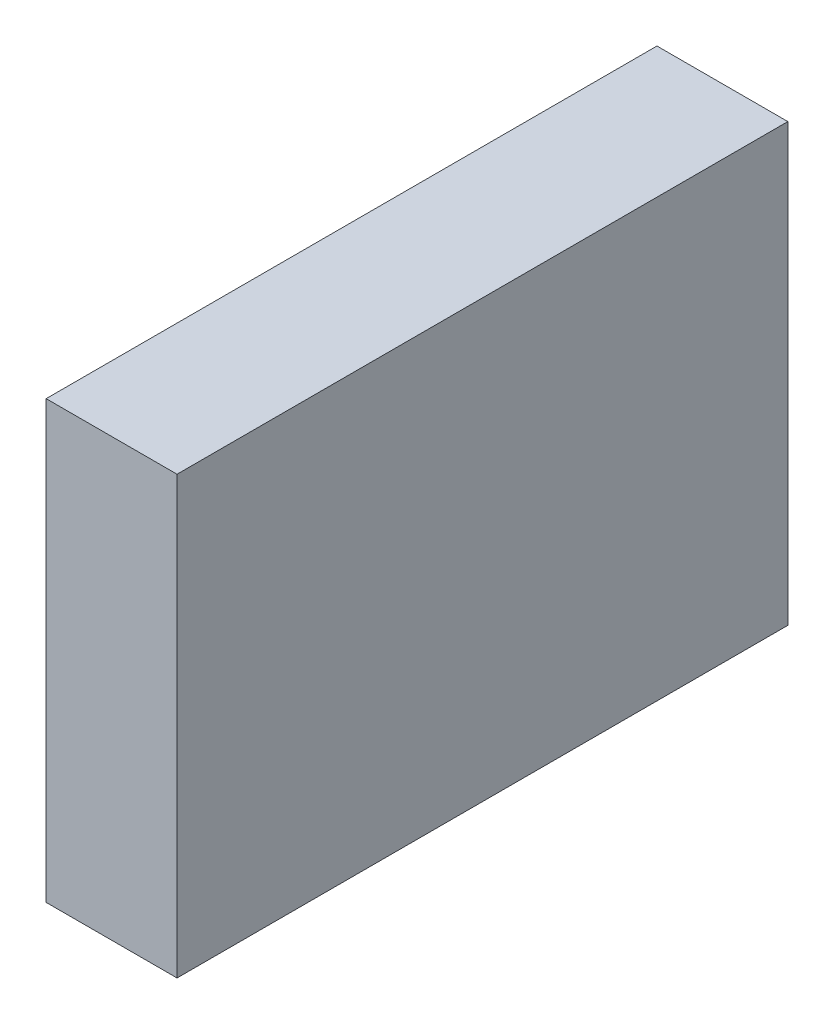
ISO-10303-21;
HEADER;
FILE_DESCRIPTION(('STEP AP214'),'2;1');
FILE_NAME('part.step','',(''),(''),'','','');
FILE_SCHEMA(('AUTOMOTIVE_DESIGN { 1 0 10303 214 1 1 1 1 }'));
ENDSEC;
DATA;
#1=APPLICATION_CONTEXT('core data for automotive mechanical design processes');
#2=APPLICATION_PROTOCOL_DEFINITION('international standard','automotive_design',2000,#1);
#3=PRODUCT_CONTEXT('',#1,'mechanical');
#4=PRODUCT('Part','Part','',(#3));
#5=PRODUCT_RELATED_PRODUCT_CATEGORY('part','',(#4));
#6=PRODUCT_DEFINITION_FORMATION('','',#4);
#7=PRODUCT_DEFINITION_CONTEXT('part definition',#1,'design');
#8=PRODUCT_DEFINITION('design','',#6,#7);
#9=PRODUCT_DEFINITION_SHAPE('','',#8);
#10=(LENGTH_UNIT() NAMED_UNIT(*) SI_UNIT(.MILLI.,.METRE.));
#11=(NAMED_UNIT(*) PLANE_ANGLE_UNIT() SI_UNIT($,.RADIAN.));
#12=(NAMED_UNIT(*) SI_UNIT($,.STERADIAN.) SOLID_ANGLE_UNIT());
#13=UNCERTAINTY_MEASURE_WITH_UNIT(LENGTH_MEASURE(1.E-05),#10,'distance_accuracy_value','');
#14=(GEOMETRIC_REPRESENTATION_CONTEXT(3) GLOBAL_UNCERTAINTY_ASSIGNED_CONTEXT((#13)) GLOBAL_UNIT_ASSIGNED_CONTEXT((#10,
#11,#12)) REPRESENTATION_CONTEXT('',''));
#15=CARTESIAN_POINT('',(0.,0.,0.));
#16=DIRECTION('',(0.,0.,1.));
#17=DIRECTION('',(1.,0.,0.));
#18=AXIS2_PLACEMENT_3D('',#15,#16,#17);
#19=CARTESIAN_POINT('',(3.,-1.82000017746824,-3.72112168010555));
#20=DIRECTION('',(1.,0.,0.));
#21=DIRECTION('',(0.,1.,8.74227765734759E-08));
#22=AXIS2_PLACEMENT_3D('',#19,#20,#21);
#23=PLANE('',#22);
#24=DIRECTION('',(0.,0.999999999999996,8.74227765733007E-08));
#25=VECTOR('',#24,1.);
#26=CARTESIAN_POINT('',(3.,-1.75000018358783,-3.65112167398595));
#27=LINE('',#26,#25);
#28=CARTESIAN_POINT('',(3.,-1.75000018358683,-3.65112167398595));
#29=VERTEX_POINT('',#28);
#30=CARTESIAN_POINT('',(3.,-0.750000183585831,-3.65112158656218));
#31=VERTEX_POINT('',#30);
#32=EDGE_CURVE('E11',#29,#31,#27,.T.);
#33=ORIENTED_EDGE('',*,*,#32,.F.);
#34=DIRECTION('',(0.,8.74227766369168E-08,-0.999999999999996));
#35=VECTOR('',#34,1.);
#36=CARTESIAN_POINT('',(3.,-1.75000030597972,-2.25112167398595));
#37=LINE('',#36,#35);
#38=CARTESIAN_POINT('',(3.,-1.75000030597972,-2.25112167398695));
#39=VERTEX_POINT('',#38);
#40=EDGE_CURVE('E59',#39,#29,#37,.T.);
#41=ORIENTED_EDGE('',*,*,#40,.F.);
#42=DIRECTION('',(0.,-0.999999999999996,-8.74227765733007E-08));
#43=VECTOR('',#42,1.);
#44=CARTESIAN_POINT('',(3.,-0.750000305977718,-2.25112158656318));
#45=LINE('',#44,#43);
#46=CARTESIAN_POINT('',(3.,-0.750000305978718,-2.25112158656318));
#47=VERTEX_POINT('',#46);
#48=EDGE_CURVE('E79',#47,#39,#45,.T.);
#49=ORIENTED_EDGE('',*,*,#48,.F.);
#50=DIRECTION('',(0.,-8.74227765576152E-08,0.999999999999996));
#51=VECTOR('',#50,1.);
#52=CARTESIAN_POINT('',(3.,-0.750000183585831,-3.65112158656318));
#53=LINE('',#52,#51);
#54=EDGE_CURVE('E84',#31,#47,#53,.T.);
#55=ORIENTED_EDGE('',*,*,#54,.F.);
#56=EDGE_LOOP('',(#33,#41,#49,#55));
#57=FACE_BOUND('',#56,.T.);
#58=ADVANCED_FACE('F17',(#57),#23,.F.);
#59=CARTESIAN_POINT('',(3.3,-1.82000017746824,-3.72112168010555));
#60=DIRECTION('',(1.,0.,0.));
#61=DIRECTION('',(0.,1.,8.74227765734759E-08));
#62=AXIS2_PLACEMENT_3D('',#59,#60,#61);
#63=PLANE('',#62);
#64=DIRECTION('',(0.,-8.74227765576152E-08,0.999999999999996));
#65=VECTOR('',#64,1.);
#66=CARTESIAN_POINT('',(3.3,-0.750000183585831,-3.65112158656318));
#67=LINE('',#66,#65);
#68=CARTESIAN_POINT('',(3.3,-0.750000183585831,-3.65112158656218));
#69=VERTEX_POINT('',#68);
#70=CARTESIAN_POINT('',(3.3,-0.750000305978718,-2.25112158656318));
#71=VERTEX_POINT('',#70);
#72=EDGE_CURVE('E24',#69,#71,#67,.T.);
#73=ORIENTED_EDGE('',*,*,#72,.T.);
#74=DIRECTION('',(0.,-0.999999999999996,-8.74227765733007E-08));
#75=VECTOR('',#74,1.);
#76=CARTESIAN_POINT('',(3.3,-0.750000305977718,-2.25112158656318));
#77=LINE('',#76,#75);
#78=CARTESIAN_POINT('',(3.3,-1.75000030597972,-2.25112167398695));
#79=VERTEX_POINT('',#78);
#80=EDGE_CURVE('E82',#71,#79,#77,.T.);
#81=ORIENTED_EDGE('',*,*,#80,.T.);
#82=DIRECTION('',(0.,8.74227764783136E-08,-0.999999999999996));
#83=VECTOR('',#82,1.);
#84=CARTESIAN_POINT('',(3.3,-1.75000030597972,-2.25112167398595));
#85=LINE('',#84,#83);
#86=CARTESIAN_POINT('',(3.3,-1.75000018358683,-3.65112167398595));
#87=VERTEX_POINT('',#86);
#88=EDGE_CURVE('E64',#79,#87,#85,.T.);
#89=ORIENTED_EDGE('',*,*,#88,.T.);
#90=DIRECTION('',(0.,0.999999999999996,8.74227765733007E-08));
#91=VECTOR('',#90,1.);
#92=CARTESIAN_POINT('',(3.3,-1.75000018358783,-3.65112167398595));
#93=LINE('',#92,#91);
#94=EDGE_CURVE('E61',#87,#69,#93,.T.);
#95=ORIENTED_EDGE('',*,*,#94,.T.);
#96=EDGE_LOOP('',(#73,#81,#89,#95));
#97=FACE_BOUND('',#96,.T.);
#98=ADVANCED_FACE('F62',(#97),#63,.T.);
#99=CARTESIAN_POINT('',(3.,-0.750000183585831,-3.65112158656318));
#100=DIRECTION('',(0.,1.,8.74227765734759E-08));
#101=DIRECTION('',(0.,-8.74227765734759E-08,1.));
#102=AXIS2_PLACEMENT_3D('',#99,#100,#101);
#103=PLANE('',#102);
#104=ORIENTED_EDGE('',*,*,#54,.T.);
#105=DIRECTION('',(1.,0.,0.));
#106=VECTOR('',#105,1.);
#107=CARTESIAN_POINT('',(3.,-0.750000305977718,-2.25112158656318));
#108=LINE('',#107,#106);
#109=EDGE_CURVE('E57',#47,#71,#108,.T.);
#110=ORIENTED_EDGE('',*,*,#109,.T.);
#111=ORIENTED_EDGE('',*,*,#72,.F.);
#112=DIRECTION('',(1.,0.,0.));
#113=VECTOR('',#112,1.);
#114=CARTESIAN_POINT('',(3.,-0.750000183585831,-3.65112158656318));
#115=LINE('',#114,#113);
#116=EDGE_CURVE('E55',#31,#69,#115,.T.);
#117=ORIENTED_EDGE('',*,*,#116,.F.);
#118=EDGE_LOOP('',(#104,#110,#111,#117));
#119=FACE_BOUND('',#118,.T.);
#120=ADVANCED_FACE('F53',(#119),#103,.T.);
#121=CARTESIAN_POINT('',(3.,-0.750000305977718,-2.25112158656318));
#122=DIRECTION('',(0.,-8.74227765734759E-08,1.));
#123=DIRECTION('',(0.,-1.,-8.74227765734759E-08));
#124=AXIS2_PLACEMENT_3D('',#121,#122,#123);
#125=PLANE('',#124);
#126=ORIENTED_EDGE('',*,*,#48,.T.);
#127=DIRECTION('',(1.,0.,0.));
#128=VECTOR('',#127,1.);
#129=CARTESIAN_POINT('',(3.,-1.75000030597972,-2.25112167398595));
#130=LINE('',#129,#128);
#131=EDGE_CURVE('E68',#39,#79,#130,.T.);
#132=ORIENTED_EDGE('',*,*,#131,.T.);
#133=ORIENTED_EDGE('',*,*,#80,.F.);
#134=ORIENTED_EDGE('',*,*,#109,.F.);
#135=EDGE_LOOP('',(#126,#132,#133,#134));
#136=FACE_BOUND('',#135,.T.);
#137=ADVANCED_FACE('F91',(#136),#125,.T.);
#138=CARTESIAN_POINT('',(3.,-1.75000030597972,-2.25112167398595));
#139=DIRECTION('',(0.,-1.,-8.74227765734759E-08));
#140=DIRECTION('',(0.,8.74227765734759E-08,-1.));
#141=AXIS2_PLACEMENT_3D('',#138,#139,#140);
#142=PLANE('',#141);
#143=ORIENTED_EDGE('',*,*,#40,.T.);
#144=DIRECTION('',(1.,0.,0.));
#145=VECTOR('',#144,1.);
#146=CARTESIAN_POINT('',(3.,-1.75000018358783,-3.65112167398595));
#147=LINE('',#146,#145);
#148=EDGE_CURVE('E69',#29,#87,#147,.T.);
#149=ORIENTED_EDGE('',*,*,#148,.T.);
#150=ORIENTED_EDGE('',*,*,#88,.F.);
#151=ORIENTED_EDGE('',*,*,#131,.F.);
#152=EDGE_LOOP('',(#143,#149,#150,#151));
#153=FACE_BOUND('',#152,.T.);
#154=ADVANCED_FACE('F88',(#153),#142,.T.);
#155=CARTESIAN_POINT('',(3.,-1.75000018358783,-3.65112167398595));
#156=DIRECTION('',(0.,8.74227765734759E-08,-1.));
#157=DIRECTION('',(0.,1.,8.74227765734759E-08));
#158=AXIS2_PLACEMENT_3D('',#155,#156,#157);
#159=PLANE('',#158);
#160=ORIENTED_EDGE('',*,*,#32,.T.);
#161=ORIENTED_EDGE('',*,*,#116,.T.);
#162=ORIENTED_EDGE('',*,*,#94,.F.);
#163=ORIENTED_EDGE('',*,*,#148,.F.);
#164=EDGE_LOOP('',(#160,#161,#162,#163));
#165=FACE_BOUND('',#164,.T.);
#166=ADVANCED_FACE('F71',(#165),#159,.T.);
#167=CLOSED_SHELL('',(#58,#98,#120,#137,#154,#166));
#168=MANIFOLD_SOLID_BREP('B1',#167);
#169=ADVANCED_BREP_SHAPE_REPRESENTATION('',(#18,#168),#14);
#170=SHAPE_DEFINITION_REPRESENTATION(#9,#169);
ENDSEC;
END-ISO-10303-21;
